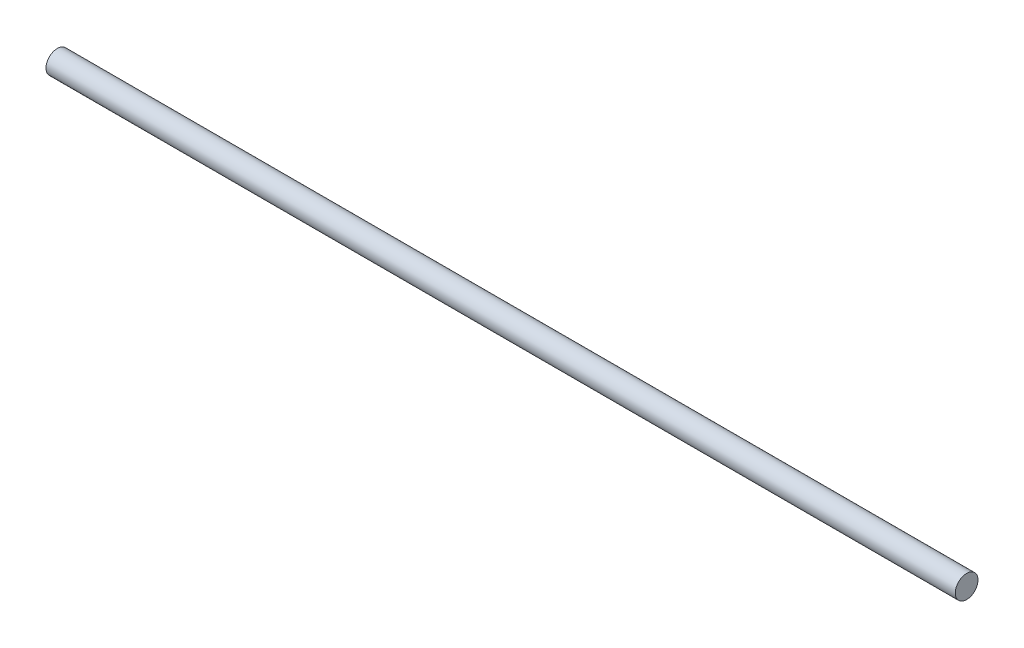
ISO-10303-21;
HEADER;
FILE_DESCRIPTION(('STEP AP214'),'2;1');
FILE_NAME('part.step','',(''),(''),'','','');
FILE_SCHEMA(('AUTOMOTIVE_DESIGN { 1 0 10303 214 1 1 1 1 }'));
ENDSEC;
DATA;
#1=APPLICATION_CONTEXT('core data for automotive mechanical design processes');
#2=APPLICATION_PROTOCOL_DEFINITION('international standard','automotive_design',2000,#1);
#3=PRODUCT_CONTEXT('',#1,'mechanical');
#4=PRODUCT('Part','Part','',(#3));
#5=PRODUCT_RELATED_PRODUCT_CATEGORY('part','',(#4));
#6=PRODUCT_DEFINITION_FORMATION('','',#4);
#7=PRODUCT_DEFINITION_CONTEXT('part definition',#1,'design');
#8=PRODUCT_DEFINITION('design','',#6,#7);
#9=PRODUCT_DEFINITION_SHAPE('','',#8);
#10=(LENGTH_UNIT() NAMED_UNIT(*) SI_UNIT(.MILLI.,.METRE.));
#11=(NAMED_UNIT(*) PLANE_ANGLE_UNIT() SI_UNIT($,.RADIAN.));
#12=(NAMED_UNIT(*) SI_UNIT($,.STERADIAN.) SOLID_ANGLE_UNIT());
#13=UNCERTAINTY_MEASURE_WITH_UNIT(LENGTH_MEASURE(1.E-05),#10,'distance_accuracy_value','');
#14=(GEOMETRIC_REPRESENTATION_CONTEXT(3) GLOBAL_UNCERTAINTY_ASSIGNED_CONTEXT((#13)) GLOBAL_UNIT_ASSIGNED_CONTEXT((#10,
#11,#12)) REPRESENTATION_CONTEXT('',''));
#15=CARTESIAN_POINT('',(0.,0.,0.));
#16=DIRECTION('',(0.,0.,1.));
#17=DIRECTION('',(1.,0.,0.));
#18=AXIS2_PLACEMENT_3D('',#15,#16,#17);
#19=CARTESIAN_POINT('',(100.,0.,0.));
#20=DIRECTION('',(-1.,0.,0.));
#21=DIRECTION('',(0.,0.,1.));
#22=AXIS2_PLACEMENT_3D('',#19,#20,#21);
#23=CYLINDRICAL_SURFACE('',#22,2.5);
#24=CARTESIAN_POINT('',(100.,0.,0.));
#25=DIRECTION('',(1.,0.,0.));
#26=DIRECTION('',(0.,0.,-1.));
#27=AXIS2_PLACEMENT_3D('',#24,#25,#26);
#28=CIRCLE('',#27,2.5);
#29=CARTESIAN_POINT('',(100.,0.,-2.5));
#30=VERTEX_POINT('',#29);
#31=EDGE_CURVE('E10',#30,#30,#28,.T.);
#32=ORIENTED_EDGE('',*,*,#31,.F.);
#33=EDGE_LOOP('',(#32));
#34=FACE_BOUND('',#33,.T.);
#35=CARTESIAN_POINT('',(-100.,0.,0.));
#36=DIRECTION('',(1.,0.,0.));
#37=DIRECTION('',(0.,0.,-1.));
#38=AXIS2_PLACEMENT_3D('',#35,#36,#37);
#39=CIRCLE('',#38,2.5);
#40=CARTESIAN_POINT('',(-100.,0.,-2.5));
#41=VERTEX_POINT('',#40);
#42=EDGE_CURVE('E34',#41,#41,#39,.T.);
#43=ORIENTED_EDGE('',*,*,#42,.T.);
#44=EDGE_LOOP('',(#43));
#45=FACE_BOUND('',#44,.T.);
#46=ADVANCED_FACE('F31',(#34,#45),#23,.T.);
#47=CARTESIAN_POINT('',(100.,0.,0.));
#48=DIRECTION('',(1.,0.,0.));
#49=DIRECTION('',(0.,0.,-1.));
#50=AXIS2_PLACEMENT_3D('',#47,#48,#49);
#51=PLANE('',#50);
#52=ORIENTED_EDGE('',*,*,#31,.T.);
#53=EDGE_LOOP('',(#52));
#54=FACE_BOUND('',#53,.T.);
#55=ADVANCED_FACE('F46',(#54),#51,.T.);
#56=CARTESIAN_POINT('',(-100.,0.,0.));
#57=DIRECTION('',(1.,0.,0.));
#58=DIRECTION('',(0.,0.,-1.));
#59=AXIS2_PLACEMENT_3D('',#56,#57,#58);
#60=PLANE('',#59);
#61=ORIENTED_EDGE('',*,*,#42,.F.);
#62=EDGE_LOOP('',(#61));
#63=FACE_BOUND('',#62,.T.);
#64=ADVANCED_FACE('F44',(#63),#60,.F.);
#65=CLOSED_SHELL('',(#46,#55,#64));
#66=MANIFOLD_SOLID_BREP('B2',#65);
#67=ADVANCED_BREP_SHAPE_REPRESENTATION('',(#18,#66),#14);
#68=SHAPE_DEFINITION_REPRESENTATION(#9,#67);
ENDSEC;
END-ISO-10303-21;
